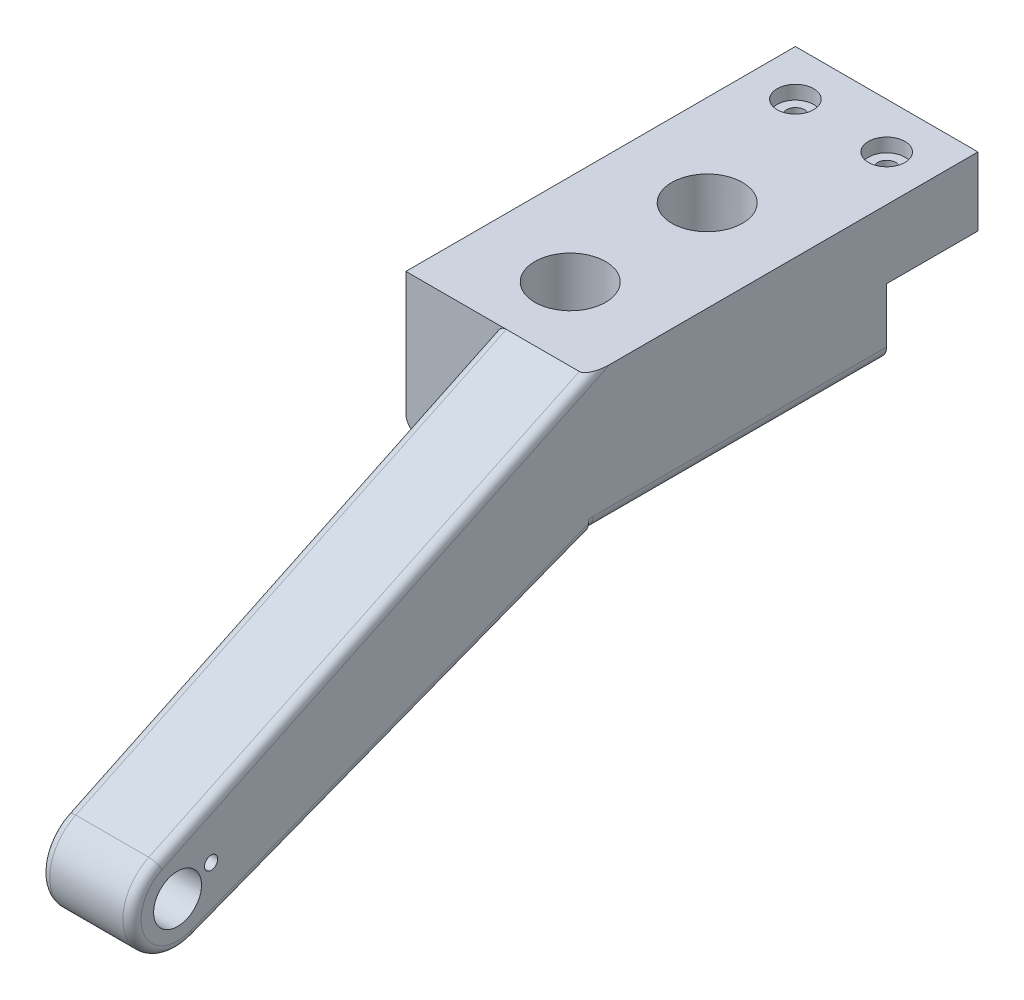
ISO-10303-21;
HEADER;
FILE_DESCRIPTION(('STEP AP214'),'2;1');
FILE_NAME('part.step','',(''),(''),'','','');
FILE_SCHEMA(('AUTOMOTIVE_DESIGN { 1 0 10303 214 1 1 1 1 }'));
ENDSEC;
DATA;
#1=APPLICATION_CONTEXT('core data for automotive mechanical design processes');
#2=APPLICATION_PROTOCOL_DEFINITION('international standard','automotive_design',2000,#1);
#3=PRODUCT_CONTEXT('',#1,'mechanical');
#4=PRODUCT('Part','Part','',(#3));
#5=PRODUCT_RELATED_PRODUCT_CATEGORY('part','',(#4));
#6=PRODUCT_DEFINITION_FORMATION('','',#4);
#7=PRODUCT_DEFINITION_CONTEXT('part definition',#1,'design');
#8=PRODUCT_DEFINITION('design','',#6,#7);
#9=PRODUCT_DEFINITION_SHAPE('','',#8);
#10=(LENGTH_UNIT() NAMED_UNIT(*) SI_UNIT(.MILLI.,.METRE.));
#11=(NAMED_UNIT(*) PLANE_ANGLE_UNIT() SI_UNIT($,.RADIAN.));
#12=(NAMED_UNIT(*) SI_UNIT($,.STERADIAN.) SOLID_ANGLE_UNIT());
#13=UNCERTAINTY_MEASURE_WITH_UNIT(LENGTH_MEASURE(1.E-05),#10,'distance_accuracy_value','');
#14=(GEOMETRIC_REPRESENTATION_CONTEXT(3) GLOBAL_UNCERTAINTY_ASSIGNED_CONTEXT((#13)) GLOBAL_UNIT_ASSIGNED_CONTEXT((#10,
#11,#12)) REPRESENTATION_CONTEXT('',''));
#15=CARTESIAN_POINT('',(0.,0.,0.));
#16=DIRECTION('',(0.,0.,1.));
#17=DIRECTION('',(1.,0.,0.));
#18=AXIS2_PLACEMENT_3D('',#15,#16,#17);
#19=CARTESIAN_POINT('',(-10.,-136.,0.677149560026454));
#20=DIRECTION('',(0.,1.,0.));
#21=DIRECTION('',(0.,0.,1.));
#22=AXIS2_PLACEMENT_3D('',#19,#20,#21);
#23=CYLINDRICAL_SURFACE('',#22,2.);
#24=CARTESIAN_POINT('',(-10.,-15.,0.677149560026454));
#25=DIRECTION('',(0.,-1.,0.));
#26=DIRECTION('',(0.,0.,-1.));
#27=AXIS2_PLACEMENT_3D('',#24,#25,#26);
#28=CIRCLE('',#27,2.);
#29=CARTESIAN_POINT('',(-10.,-15.,-1.32285043997355));
#30=VERTEX_POINT('',#29);
#31=EDGE_CURVE('E171',#30,#30,#28,.T.);
#32=ORIENTED_EDGE('',*,*,#31,.T.);
#33=EDGE_LOOP('',(#32));
#34=FACE_BOUND('',#33,.T.);
#35=CARTESIAN_POINT('',(-10.,-3.,0.677149560026454));
#36=DIRECTION('',(0.,1.,0.));
#37=DIRECTION('',(0.,0.,1.));
#38=AXIS2_PLACEMENT_3D('',#35,#36,#37);
#39=CIRCLE('',#38,2.);
#40=CARTESIAN_POINT('',(-10.,-3.,2.67714956002645));
#41=VERTEX_POINT('',#40);
#42=EDGE_CURVE('E174',#41,#41,#39,.F.);
#43=ORIENTED_EDGE('',*,*,#42,.F.);
#44=EDGE_LOOP('',(#43));
#45=FACE_BOUND('',#44,.T.);
#46=ADVANCED_FACE('F76',(#34,#45),#23,.F.);
#47=CARTESIAN_POINT('',(10.,-136.,0.677149560026454));
#48=DIRECTION('',(0.,1.,0.));
#49=DIRECTION('',(0.,0.,1.));
#50=AXIS2_PLACEMENT_3D('',#47,#48,#49);
#51=CYLINDRICAL_SURFACE('',#50,2.);
#52=CARTESIAN_POINT('',(10.,-15.,0.677149560026454));
#53=DIRECTION('',(0.,-1.,0.));
#54=DIRECTION('',(0.,0.,-1.));
#55=AXIS2_PLACEMENT_3D('',#52,#53,#54);
#56=CIRCLE('',#55,2.);
#57=CARTESIAN_POINT('',(10.,-15.,-1.32285043997355));
#58=VERTEX_POINT('',#57);
#59=EDGE_CURVE('E137',#58,#58,#56,.T.);
#60=ORIENTED_EDGE('',*,*,#59,.T.);
#61=EDGE_LOOP('',(#60));
#62=FACE_BOUND('',#61,.T.);
#63=CARTESIAN_POINT('',(10.,-3.,0.677149560026454));
#64=DIRECTION('',(0.,1.,0.));
#65=DIRECTION('',(0.,0.,1.));
#66=AXIS2_PLACEMENT_3D('',#63,#64,#65);
#67=CIRCLE('',#66,2.);
#68=CARTESIAN_POINT('',(10.,-3.,2.67714956002645));
#69=VERTEX_POINT('',#68);
#70=EDGE_CURVE('E177',#69,#69,#67,.F.);
#71=ORIENTED_EDGE('',*,*,#70,.F.);
#72=EDGE_LOOP('',(#71));
#73=FACE_BOUND('',#72,.T.);
#74=ADVANCED_FACE('F440',(#62,#73),#51,.F.);
#75=CARTESIAN_POINT('',(20.,-30.,75.));
#76=DIRECTION('',(1.,0.,0.));
#77=DIRECTION('',(0.,0.,-1.));
#78=AXIS2_PLACEMENT_3D('',#75,#76,#77);
#79=PLANE('',#78);
#80=CARTESIAN_POINT('',(20.,-50.8479139991392,158.66456978192));
#81=DIRECTION('',(1.,0.,0.));
#82=DIRECTION('',(0.,0.,-1.));
#83=AXIS2_PLACEMENT_3D('',#80,#81,#82);
#84=CIRCLE('',#83,1.45);
#85=CARTESIAN_POINT('',(20.,-50.8479139991392,157.21456978192));
#86=VERTEX_POINT('',#85);
#87=EDGE_CURVE('E196',#86,#86,#84,.T.);
#88=ORIENTED_EDGE('',*,*,#87,.F.);
#89=EDGE_LOOP('',(#88));
#90=FACE_BOUND('',#89,.T.);
#91=CARTESIAN_POINT('',(20.,-54.0121821289708,166.012182128971));
#92=DIRECTION('',(1.,0.,0.));
#93=DIRECTION('',(0.,0.,-1.));
#94=AXIS2_PLACEMENT_3D('',#91,#92,#93);
#95=CIRCLE('',#94,5.25);
#96=CARTESIAN_POINT('',(20.,-54.0121821289708,160.762182128971));
#97=VERTEX_POINT('',#96);
#98=EDGE_CURVE('E185',#97,#97,#95,.T.);
#99=ORIENTED_EDGE('',*,*,#98,.F.);
#100=EDGE_LOOP('',(#99));
#101=FACE_BOUND('',#100,.T.);
#102=DIRECTION('',(0.,0.,-1.));
#103=VECTOR('',#102,1.);
#104=CARTESIAN_POINT('',(20.,-15.,0.));
#105=LINE('',#104,#103);
#106=CARTESIAN_POINT('',(20.,-15.,10.6771495600264));
#107=VERTEX_POINT('',#106);
#108=CARTESIAN_POINT('',(20.,-15.,-9.32285043997355));
#109=VERTEX_POINT('',#108);
#110=EDGE_CURVE('E132',#107,#109,#105,.T.);
#111=ORIENTED_EDGE('',*,*,#110,.T.);
#112=DIRECTION('',(0.,1.,0.));
#113=VECTOR('',#112,1.);
#114=CARTESIAN_POINT('',(20.,0.,-9.32285043997355));
#115=LINE('',#114,#113);
#116=CARTESIAN_POINT('',(20.,0.,-9.32285043997355));
#117=VERTEX_POINT('',#116);
#118=EDGE_CURVE('E136',#109,#117,#115,.T.);
#119=ORIENTED_EDGE('',*,*,#118,.T.);
#120=DIRECTION('',(0.,0.,-1.));
#121=VECTOR('',#120,1.);
#122=CARTESIAN_POINT('',(20.,0.,75.));
#123=LINE('',#122,#121);
#124=CARTESIAN_POINT('',(20.,0.,71.3542991200529));
#125=VERTEX_POINT('',#124);
#126=EDGE_CURVE('E155',#125,#117,#123,.T.);
#127=ORIENTED_EDGE('',*,*,#126,.F.);
#128=DIRECTION('',(0.,0.430505547318578,-0.902587931299733));
#129=VECTOR('',#128,1.);
#130=CARTESIAN_POINT('',(20.,-6.9766575393942,85.9813972726549));
#131=LINE('',#130,#129);
#132=CARTESIAN_POINT('',(20.,-46.7914786785729,169.456226507519));
#133=VERTEX_POINT('',#132);
#134=EDGE_CURVE('E154',#125,#133,#131,.F.);
#135=ORIENTED_EDGE('',*,*,#134,.T.);
#136=CARTESIAN_POINT('',(20.,-54.0121821289708,166.012182128971));
#137=DIRECTION('',(1.,0.,0.));
#138=DIRECTION('',(0.,0.,-1.));
#139=AXIS2_PLACEMENT_3D('',#136,#137,#138);
#140=CIRCLE('',#139,8.00000000000001);
#141=CARTESIAN_POINT('',(20.,-61.4758678697103,163.132356585039));
#142=VERTEX_POINT('',#141);
#143=EDGE_CURVE('E293',#133,#142,#140,.T.);
#144=ORIENTED_EDGE('',*,*,#143,.T.);
#145=DIRECTION('',(0.,0.359978192991459,-0.932960717592442));
#146=VECTOR('',#145,1.);
#147=CARTESIAN_POINT('',(20.,-28.1340785648151,76.7199563859829));
#148=LINE('',#147,#146);
#149=CARTESIAN_POINT('',(20.,-27.8562870201426,76.));
#150=VERTEX_POINT('',#149);
#151=EDGE_CURVE('E289',#142,#150,#148,.T.);
#152=ORIENTED_EDGE('',*,*,#151,.T.);
#153=DIRECTION('',(0.,1.,0.));
#154=VECTOR('',#153,1.);
#155=CARTESIAN_POINT('',(20.,0.,76.));
#156=LINE('',#155,#154);
#157=CARTESIAN_POINT('',(20.,-27.,76.));
#158=VERTEX_POINT('',#157);
#159=EDGE_CURVE('E292',#150,#158,#156,.T.);
#160=ORIENTED_EDGE('',*,*,#159,.T.);
#161=DIRECTION('',(0.,0.,-1.));
#162=VECTOR('',#161,1.);
#163=CARTESIAN_POINT('',(20.,-27.,75.));
#164=LINE('',#163,#162);
#165=CARTESIAN_POINT('',(20.,-27.,75.));
#166=VERTEX_POINT('',#165);
#167=EDGE_CURVE('E148',#158,#166,#164,.T.);
#168=ORIENTED_EDGE('',*,*,#167,.T.);
#169=DIRECTION('',(0.,0.,-1.));
#170=VECTOR('',#169,1.);
#171=CARTESIAN_POINT('',(20.,-27.,-25.));
#172=LINE('',#171,#170);
#173=CARTESIAN_POINT('',(20.,-27.,10.6771495600264));
#174=VERTEX_POINT('',#173);
#175=EDGE_CURVE('E142',#166,#174,#172,.T.);
#176=ORIENTED_EDGE('',*,*,#175,.T.);
#177=DIRECTION('',(0.,1.,0.));
#178=VECTOR('',#177,1.);
#179=CARTESIAN_POINT('',(20.,0.,10.6771495600264));
#180=LINE('',#179,#178);
#181=EDGE_CURVE('E126',#174,#107,#180,.T.);
#182=ORIENTED_EDGE('',*,*,#181,.T.);
#183=EDGE_LOOP('',(#111,#119,#127,#135,#144,#152,#160,#168,#176,#182));
#184=FACE_BOUND('',#183,.T.);
#185=ADVANCED_FACE('F78',(#90,#101,#184),#79,.T.);
#186=CARTESIAN_POINT('',(-20.,-30.,75.));
#187=DIRECTION('',(1.,0.,0.));
#188=DIRECTION('',(0.,0.,-1.));
#189=AXIS2_PLACEMENT_3D('',#186,#187,#188);
#190=PLANE('',#189);
#191=DIRECTION('',(0.,1.,0.));
#192=VECTOR('',#191,1.);
#193=CARTESIAN_POINT('',(-20.,-30.,-9.32285043997355));
#194=LINE('',#193,#192);
#195=CARTESIAN_POINT('',(-20.,-15.,-9.32285043997355));
#196=VERTEX_POINT('',#195);
#197=CARTESIAN_POINT('',(-20.,0.,-9.32285043997355));
#198=VERTEX_POINT('',#197);
#199=EDGE_CURVE('E234',#196,#198,#194,.T.);
#200=ORIENTED_EDGE('',*,*,#199,.F.);
#201=DIRECTION('',(0.,0.,-1.));
#202=VECTOR('',#201,1.);
#203=CARTESIAN_POINT('',(-20.,-15.,75.));
#204=LINE('',#203,#202);
#205=CARTESIAN_POINT('',(-20.,-15.,10.6771495600264));
#206=VERTEX_POINT('',#205);
#207=EDGE_CURVE('E85',#206,#196,#204,.T.);
#208=ORIENTED_EDGE('',*,*,#207,.F.);
#209=DIRECTION('',(0.,1.,0.));
#210=VECTOR('',#209,1.);
#211=CARTESIAN_POINT('',(-20.,-30.,10.6771495600265));
#212=LINE('',#211,#210);
#213=CARTESIAN_POINT('',(-20.,-27.,10.6771495600264));
#214=VERTEX_POINT('',#213);
#215=EDGE_CURVE('E129',#214,#206,#212,.T.);
#216=ORIENTED_EDGE('',*,*,#215,.F.);
#217=DIRECTION('',(0.,0.,-1.));
#218=VECTOR('',#217,1.);
#219=CARTESIAN_POINT('',(-20.,-27.,75.));
#220=LINE('',#219,#218);
#221=CARTESIAN_POINT('',(-20.,-27.,75.));
#222=VERTEX_POINT('',#221);
#223=EDGE_CURVE('E143',#214,#222,#220,.F.);
#224=ORIENTED_EDGE('',*,*,#223,.T.);
#225=DIRECTION('',(0.,0.,-1.));
#226=VECTOR('',#225,1.);
#227=CARTESIAN_POINT('',(-20.,-27.,75.));
#228=LINE('',#227,#226);
#229=CARTESIAN_POINT('',(-20.,-27.,76.));
#230=VERTEX_POINT('',#229);
#231=EDGE_CURVE('E146',#222,#230,#228,.F.);
#232=ORIENTED_EDGE('',*,*,#231,.T.);
#233=DIRECTION('',(0.,-1.,0.));
#234=VECTOR('',#233,1.);
#235=CARTESIAN_POINT('',(-20.,0.,76.));
#236=LINE('',#235,#234);
#237=CARTESIAN_POINT('',(-20.,0.,76.));
#238=VERTEX_POINT('',#237);
#239=EDGE_CURVE('E244',#238,#230,#236,.T.);
#240=ORIENTED_EDGE('',*,*,#239,.F.);
#241=DIRECTION('',(0.,0.,-1.));
#242=VECTOR('',#241,1.);
#243=CARTESIAN_POINT('',(-20.,0.,75.));
#244=LINE('',#243,#242);
#245=EDGE_CURVE('E159',#238,#198,#244,.T.);
#246=ORIENTED_EDGE('',*,*,#245,.T.);
#247=EDGE_LOOP('',(#200,#208,#216,#224,#232,#240,#246));
#248=FACE_BOUND('',#247,.T.);
#249=ADVANCED_FACE('F539',(#248),#190,.F.);
#250=CARTESIAN_POINT('',(0.,0.,0.));
#251=DIRECTION('',(0.,1.,0.));
#252=DIRECTION('',(0.,0.,1.));
#253=AXIS2_PLACEMENT_3D('',#250,#251,#252);
#254=PLANE('',#253);
#255=CARTESIAN_POINT('',(0.,0.,60.));
#256=DIRECTION('',(0.,1.,0.));
#257=DIRECTION('',(0.,0.,1.));
#258=AXIS2_PLACEMENT_3D('',#255,#256,#257);
#259=CIRCLE('',#258,7.75);
#260=CARTESIAN_POINT('',(0.,0.,67.75));
#261=VERTEX_POINT('',#260);
#262=EDGE_CURVE('E199',#261,#261,#259,.T.);
#263=ORIENTED_EDGE('',*,*,#262,.F.);
#264=EDGE_LOOP('',(#263));
#265=FACE_BOUND('',#264,.T.);
#266=CARTESIAN_POINT('',(0.,0.,30.));
#267=DIRECTION('',(0.,1.,0.));
#268=DIRECTION('',(0.,0.,1.));
#269=AXIS2_PLACEMENT_3D('',#266,#267,#268);
#270=CIRCLE('',#269,7.75);
#271=CARTESIAN_POINT('',(0.,0.,37.75));
#272=VERTEX_POINT('',#271);
#273=EDGE_CURVE('E184',#272,#272,#270,.T.);
#274=ORIENTED_EDGE('',*,*,#273,.F.);
#275=EDGE_LOOP('',(#274));
#276=FACE_BOUND('',#275,.T.);
#277=CARTESIAN_POINT('',(10.,0.,0.677149560026454));
#278=DIRECTION('',(0.,1.,0.));
#279=DIRECTION('',(0.,0.,1.));
#280=AXIS2_PLACEMENT_3D('',#277,#278,#279);
#281=CIRCLE('',#280,4.);
#282=CARTESIAN_POINT('',(10.,0.,4.67714956002646));
#283=VERTEX_POINT('',#282);
#284=EDGE_CURVE('E210',#283,#283,#281,.T.);
#285=ORIENTED_EDGE('',*,*,#284,.F.);
#286=EDGE_LOOP('',(#285));
#287=FACE_BOUND('',#286,.T.);
#288=CARTESIAN_POINT('',(-10.,0.,0.677149560026454));
#289=DIRECTION('',(0.,1.,0.));
#290=DIRECTION('',(0.,0.,1.));
#291=AXIS2_PLACEMENT_3D('',#288,#289,#290);
#292=CIRCLE('',#291,4.);
#293=CARTESIAN_POINT('',(-10.,0.,4.67714956002646));
#294=VERTEX_POINT('',#293);
#295=EDGE_CURVE('E204',#294,#294,#292,.T.);
#296=ORIENTED_EDGE('',*,*,#295,.F.);
#297=EDGE_LOOP('',(#296));
#298=FACE_BOUND('',#297,.T.);
#299=ORIENTED_EDGE('',*,*,#126,.T.);
#300=DIRECTION('',(-1.,0.,0.));
#301=VECTOR('',#300,1.);
#302=CARTESIAN_POINT('',(0.,0.,-9.32285043997355));
#303=LINE('',#302,#301);
#304=EDGE_CURVE('E158',#117,#198,#303,.T.);
#305=ORIENTED_EDGE('',*,*,#304,.T.);
#306=ORIENTED_EDGE('',*,*,#245,.F.);
#307=DIRECTION('',(1.,0.,0.));
#308=VECTOR('',#307,1.);
#309=CARTESIAN_POINT('',(20.,0.,76.));
#310=LINE('',#309,#308);
#311=CARTESIAN_POINT('',(2.00000000000003,0.,76.));
#312=VERTEX_POINT('',#311);
#313=EDGE_CURVE('E221',#238,#312,#310,.T.);
#314=ORIENTED_EDGE('',*,*,#313,.T.);
#315=DIRECTION('',(-1.,0.,0.));
#316=VECTOR('',#315,1.);
#317=CARTESIAN_POINT('',(104.165905469516,0.,76.));
#318=LINE('',#317,#316);
#319=CARTESIAN_POINT('',(18.,0.,76.));
#320=VERTEX_POINT('',#319);
#321=EDGE_CURVE('E256',#320,#312,#318,.T.);
#322=ORIENTED_EDGE('',*,*,#321,.F.);
#323=CARTESIAN_POINT('',(18.,0.,71.3542991200529));
#324=DIRECTION('',(0.,1.,0.));
#325=DIRECTION('',(0.,0.,-1.));
#326=AXIS2_PLACEMENT_3D('',#323,#324,#325);
#327=ELLIPSE('',#326,4.64570087994704,2.);
#328=EDGE_CURVE('E250',#320,#125,#327,.T.);
#329=ORIENTED_EDGE('',*,*,#328,.T.);
#330=EDGE_LOOP('',(#299,#305,#306,#314,#322,#329));
#331=FACE_BOUND('',#330,.T.);
#332=ADVANCED_FACE('F536',(#265,#276,#287,#298,#331),#254,.T.);
#333=CARTESIAN_POINT('',(0.,-30.,0.));
#334=DIRECTION('',(0.,1.,0.));
#335=DIRECTION('',(0.,0.,1.));
#336=AXIS2_PLACEMENT_3D('',#333,#334,#335);
#337=PLANE('',#336);
#338=CARTESIAN_POINT('',(0.,-30.,60.));
#339=DIRECTION('',(0.,-1.,0.));
#340=DIRECTION('',(0.,0.,-1.));
#341=AXIS2_PLACEMENT_3D('',#338,#339,#340);
#342=CIRCLE('',#341,6.);
#343=CARTESIAN_POINT('',(0.,-30.,54.));
#344=VERTEX_POINT('',#343);
#345=EDGE_CURVE('E310',#344,#344,#342,.T.);
#346=ORIENTED_EDGE('',*,*,#345,.F.);
#347=EDGE_LOOP('',(#346));
#348=FACE_BOUND('',#347,.T.);
#349=CARTESIAN_POINT('',(0.,-30.,30.));
#350=DIRECTION('',(0.,-1.,0.));
#351=DIRECTION('',(0.,0.,-1.));
#352=AXIS2_PLACEMENT_3D('',#349,#350,#351);
#353=CIRCLE('',#352,6.);
#354=CARTESIAN_POINT('',(0.,-30.,24.));
#355=VERTEX_POINT('',#354);
#356=EDGE_CURVE('E288',#355,#355,#353,.T.);
#357=ORIENTED_EDGE('',*,*,#356,.F.);
#358=EDGE_LOOP('',(#357));
#359=FACE_BOUND('',#358,.T.);
#360=DIRECTION('',(1.,0.,0.));
#361=VECTOR('',#360,1.);
#362=CARTESIAN_POINT('',(-29.,-30.,10.6771495600264));
#363=LINE('',#362,#361);
#364=CARTESIAN_POINT('',(-17.,-30.,10.6771495600264));
#365=VERTEX_POINT('',#364);
#366=CARTESIAN_POINT('',(17.,-30.,10.6771495600265));
#367=VERTEX_POINT('',#366);
#368=EDGE_CURVE('E151',#365,#367,#363,.T.);
#369=ORIENTED_EDGE('',*,*,#368,.T.);
#370=DIRECTION('',(0.,0.,-1.));
#371=VECTOR('',#370,1.);
#372=CARTESIAN_POINT('',(17.,-30.,135.));
#373=LINE('',#372,#371);
#374=CARTESIAN_POINT('',(17.,-30.,75.));
#375=VERTEX_POINT('',#374);
#376=EDGE_CURVE('E165',#367,#375,#373,.F.);
#377=ORIENTED_EDGE('',*,*,#376,.T.);
#378=DIRECTION('',(0.,0.,-1.));
#379=VECTOR('',#378,1.);
#380=CARTESIAN_POINT('',(17.,-30.,76.));
#381=LINE('',#380,#379);
#382=CARTESIAN_POINT('',(17.,-30.,76.));
#383=VERTEX_POINT('',#382);
#384=EDGE_CURVE('E167',#375,#383,#381,.F.);
#385=ORIENTED_EDGE('',*,*,#384,.T.);
#386=DIRECTION('',(1.,0.,0.));
#387=VECTOR('',#386,1.);
#388=CARTESIAN_POINT('',(20.,-30.,76.));
#389=LINE('',#388,#387);
#390=CARTESIAN_POINT('',(2.,-30.,76.));
#391=VERTEX_POINT('',#390);
#392=EDGE_CURVE('E238',#391,#383,#389,.T.);
#393=ORIENTED_EDGE('',*,*,#392,.F.);
#394=CARTESIAN_POINT('',(-17.,-30.,76.));
#395=VERTEX_POINT('',#394);
#396=EDGE_CURVE('E249',#395,#391,#389,.T.);
#397=ORIENTED_EDGE('',*,*,#396,.F.);
#398=DIRECTION('',(0.,0.,-1.));
#399=VECTOR('',#398,1.);
#400=CARTESIAN_POINT('',(-17.,-30.,0.));
#401=LINE('',#400,#399);
#402=CARTESIAN_POINT('',(-17.,-30.,75.));
#403=VERTEX_POINT('',#402);
#404=EDGE_CURVE('E164',#395,#403,#401,.T.);
#405=ORIENTED_EDGE('',*,*,#404,.T.);
#406=DIRECTION('',(0.,0.,-1.));
#407=VECTOR('',#406,1.);
#408=CARTESIAN_POINT('',(-17.,-30.,0.));
#409=LINE('',#408,#407);
#410=EDGE_CURVE('E160',#403,#365,#409,.T.);
#411=ORIENTED_EDGE('',*,*,#410,.T.);
#412=EDGE_LOOP('',(#369,#377,#385,#393,#397,#405,#411));
#413=FACE_BOUND('',#412,.T.);
#414=ADVANCED_FACE('F351',(#348,#359,#413),#337,.F.);
#415=CARTESIAN_POINT('',(17.,-27.,75.));
#416=DIRECTION('',(0.,0.,1.));
#417=DIRECTION('',(1.,0.,0.));
#418=AXIS2_PLACEMENT_3D('',#415,#416,#417);
#419=CYLINDRICAL_SURFACE('',#418,3.);
#420=ORIENTED_EDGE('',*,*,#376,.F.);
#421=CARTESIAN_POINT('',(17.,-27.,10.6771495600265));
#422=DIRECTION('',(0.,0.,-1.));
#423=DIRECTION('',(-1.,0.,0.));
#424=AXIS2_PLACEMENT_3D('',#421,#422,#423);
#425=CIRCLE('',#424,3.);
#426=EDGE_CURVE('E163',#367,#174,#425,.F.);
#427=ORIENTED_EDGE('',*,*,#426,.T.);
#428=ORIENTED_EDGE('',*,*,#175,.F.);
#429=CARTESIAN_POINT('',(17.,-27.,75.));
#430=DIRECTION('',(0.,0.,1.));
#431=DIRECTION('',(1.,0.,0.));
#432=AXIS2_PLACEMENT_3D('',#429,#430,#431);
#433=CIRCLE('',#432,3.);
#434=EDGE_CURVE('E226',#166,#375,#433,.F.);
#435=ORIENTED_EDGE('',*,*,#434,.T.);
#436=EDGE_LOOP('',(#420,#427,#428,#435));
#437=FACE_BOUND('',#436,.T.);
#438=ADVANCED_FACE('F347',(#437),#419,.T.);
#439=CARTESIAN_POINT('',(-17.,-27.,0.));
#440=DIRECTION('',(0.,0.,-1.));
#441=DIRECTION('',(-1.,0.,0.));
#442=AXIS2_PLACEMENT_3D('',#439,#440,#441);
#443=CYLINDRICAL_SURFACE('',#442,3.);
#444=ORIENTED_EDGE('',*,*,#223,.F.);
#445=CARTESIAN_POINT('',(-17.,-27.,10.6771495600264));
#446=DIRECTION('',(0.,0.,-1.));
#447=DIRECTION('',(-1.,0.,0.));
#448=AXIS2_PLACEMENT_3D('',#445,#446,#447);
#449=CIRCLE('',#448,3.);
#450=EDGE_CURVE('E222',#214,#365,#449,.F.);
#451=ORIENTED_EDGE('',*,*,#450,.T.);
#452=ORIENTED_EDGE('',*,*,#410,.F.);
#453=CARTESIAN_POINT('',(-17.,-27.,75.));
#454=DIRECTION('',(0.,0.,1.));
#455=DIRECTION('',(1.,0.,0.));
#456=AXIS2_PLACEMENT_3D('',#453,#454,#455);
#457=CIRCLE('',#456,3.);
#458=EDGE_CURVE('E225',#403,#222,#457,.F.);
#459=ORIENTED_EDGE('',*,*,#458,.T.);
#460=EDGE_LOOP('',(#444,#451,#452,#459));
#461=FACE_BOUND('',#460,.T.);
#462=ADVANCED_FACE('F360',(#461),#443,.T.);
#463=CARTESIAN_POINT('',(0.,-50.0121821289708,125.012182128971));
#464=DIRECTION('',(1.,0.,0.));
#465=DIRECTION('',(0.,0.,-1.));
#466=AXIS2_PLACEMENT_3D('',#463,#464,#465);
#467=PLANE('',#466);
#468=CARTESIAN_POINT('',(0.,-50.8479139991392,158.66456978192));
#469=DIRECTION('',(1.,0.,0.));
#470=DIRECTION('',(0.,0.,-1.));
#471=AXIS2_PLACEMENT_3D('',#468,#469,#470);
#472=CIRCLE('',#471,1.45);
#473=CARTESIAN_POINT('',(0.,-50.8479139991392,157.21456978192));
#474=VERTEX_POINT('',#473);
#475=EDGE_CURVE('E80',#474,#474,#472,.T.);
#476=ORIENTED_EDGE('',*,*,#475,.T.);
#477=EDGE_LOOP('',(#476));
#478=FACE_BOUND('',#477,.T.);
#479=CARTESIAN_POINT('',(0.,-54.0121821289708,166.012182128971));
#480=DIRECTION('',(1.,0.,0.));
#481=DIRECTION('',(0.,0.,-1.));
#482=AXIS2_PLACEMENT_3D('',#479,#480,#481);
#483=CIRCLE('',#482,5.25);
#484=CARTESIAN_POINT('',(0.,-54.0121821289708,160.762182128971));
#485=VERTEX_POINT('',#484);
#486=EDGE_CURVE('E182',#485,#485,#483,.T.);
#487=ORIENTED_EDGE('',*,*,#486,.T.);
#488=EDGE_LOOP('',(#487));
#489=FACE_BOUND('',#488,.T.);
#490=DIRECTION('',(0.,1.,0.));
#491=VECTOR('',#490,1.);
#492=CARTESIAN_POINT('',(0.,0.,76.));
#493=LINE('',#492,#491);
#494=CARTESIAN_POINT('',(0.,-27.8562870201426,76.));
#495=VERTEX_POINT('',#494);
#496=CARTESIAN_POINT('',(0.,-2.21585058989212,76.));
#497=VERTEX_POINT('',#496);
#498=EDGE_CURVE('E245',#495,#497,#493,.T.);
#499=ORIENTED_EDGE('',*,*,#498,.F.);
#500=DIRECTION('',(0.,0.359978192991459,-0.932960717592442));
#501=VECTOR('',#500,1.);
#502=CARTESIAN_POINT('',(0.,-47.1878646287041,126.101930808641));
#503=LINE('',#502,#501);
#504=CARTESIAN_POINT('',(0.,-61.4758678697103,163.132356585039));
#505=VERTEX_POINT('',#504);
#506=EDGE_CURVE('E262',#495,#505,#503,.F.);
#507=ORIENTED_EDGE('',*,*,#506,.T.);
#508=CARTESIAN_POINT('',(0.,-54.0121821289708,166.012182128971));
#509=DIRECTION('',(1.,0.,0.));
#510=DIRECTION('',(0.,0.,-1.));
#511=AXIS2_PLACEMENT_3D('',#508,#509,#510);
#512=CIRCLE('',#511,8.00000000000001);
#513=CARTESIAN_POINT('',(0.,-46.7914786785729,169.456226507519));
#514=VERTEX_POINT('',#513);
#515=EDGE_CURVE('E265',#505,#514,#512,.F.);
#516=ORIENTED_EDGE('',*,*,#515,.T.);
#517=DIRECTION('',(0.,0.430505547318578,-0.902587931299733));
#518=VECTOR('',#517,1.);
#519=CARTESIAN_POINT('',(0.,-1.80517586259947,75.1389889053628));
#520=LINE('',#519,#518);
#521=EDGE_CURVE('E268',#514,#497,#520,.T.);
#522=ORIENTED_EDGE('',*,*,#521,.T.);
#523=EDGE_LOOP('',(#499,#507,#516,#522));
#524=FACE_BOUND('',#523,.T.);
#525=ADVANCED_FACE('F480',(#478,#489,#524),#467,.F.);
#526=CARTESIAN_POINT('',(0.,0.,76.));
#527=DIRECTION('',(0.,0.,1.));
#528=DIRECTION('',(1.,0.,0.));
#529=AXIS2_PLACEMENT_3D('',#526,#527,#528);
#530=PLANE('',#529);
#531=ORIENTED_EDGE('',*,*,#396,.T.);
#532=CARTESIAN_POINT('',(2.,-27.8562870201426,76.));
#533=DIRECTION('',(0.,0.,1.));
#534=DIRECTION('',(0.,1.,0.));
#535=AXIS2_PLACEMENT_3D('',#532,#533,#534);
#536=ELLIPSE('',#535,2.14371297985741,2.);
#537=EDGE_CURVE('E246',#391,#495,#536,.F.);
#538=ORIENTED_EDGE('',*,*,#537,.T.);
#539=ORIENTED_EDGE('',*,*,#498,.T.);
#540=CARTESIAN_POINT('',(2.,-2.21585058989211,76.));
#541=DIRECTION('',(0.,0.,1.));
#542=DIRECTION('',(0.,-1.,0.));
#543=AXIS2_PLACEMENT_3D('',#540,#541,#542);
#544=ELLIPSE('',#543,2.2158505898921,2.);
#545=EDGE_CURVE('E241',#497,#312,#544,.F.);
#546=ORIENTED_EDGE('',*,*,#545,.T.);
#547=ORIENTED_EDGE('',*,*,#313,.F.);
#548=ORIENTED_EDGE('',*,*,#239,.T.);
#549=CARTESIAN_POINT('',(-17.,-27.,76.));
#550=DIRECTION('',(0.,0.,1.));
#551=DIRECTION('',(1.,0.,0.));
#552=AXIS2_PLACEMENT_3D('',#549,#550,#551);
#553=CIRCLE('',#552,3.);
#554=EDGE_CURVE('E300',#230,#395,#553,.T.);
#555=ORIENTED_EDGE('',*,*,#554,.T.);
#556=EDGE_LOOP('',(#531,#538,#539,#546,#547,#548,#555));
#557=FACE_BOUND('',#556,.T.);
#558=ADVANCED_FACE('F476',(#557),#530,.T.);
#559=CARTESIAN_POINT('',(0.,-25.,60.));
#560=DIRECTION('',(0.,-1.,0.));
#561=DIRECTION('',(0.,0.,-1.));
#562=AXIS2_PLACEMENT_3D('',#559,#560,#561);
#563=PLANE('',#562);
#564=CARTESIAN_POINT('',(0.,-25.,60.));
#565=DIRECTION('',(0.,-1.,0.));
#566=DIRECTION('',(0.,0.,-1.));
#567=AXIS2_PLACEMENT_3D('',#564,#565,#566);
#568=CIRCLE('',#567,6.);
#569=CARTESIAN_POINT('',(0.,-25.,54.));
#570=VERTEX_POINT('',#569);
#571=EDGE_CURVE('E313',#570,#570,#568,.T.);
#572=ORIENTED_EDGE('',*,*,#571,.T.);
#573=EDGE_LOOP('',(#572));
#574=FACE_BOUND('',#573,.T.);
#575=CARTESIAN_POINT('',(0.,-25.,60.));
#576=DIRECTION('',(0.,-1.,0.));
#577=DIRECTION('',(0.,0.,-1.));
#578=AXIS2_PLACEMENT_3D('',#575,#576,#577);
#579=CIRCLE('',#578,7.75);
#580=CARTESIAN_POINT('',(0.,-25.,52.25));
#581=VERTEX_POINT('',#580);
#582=EDGE_CURVE('E202',#581,#581,#579,.F.);
#583=ORIENTED_EDGE('',*,*,#582,.T.);
#584=EDGE_LOOP('',(#583));
#585=FACE_BOUND('',#584,.T.);
#586=ADVANCED_FACE('F479',(#574,#585),#563,.F.);
#587=CARTESIAN_POINT('',(0.,-25.,60.));
#588=DIRECTION('',(0.,-1.,0.));
#589=DIRECTION('',(0.,0.,-1.));
#590=AXIS2_PLACEMENT_3D('',#587,#588,#589);
#591=CYLINDRICAL_SURFACE('',#590,6.);
#592=ORIENTED_EDGE('',*,*,#571,.F.);
#593=EDGE_LOOP('',(#592));
#594=FACE_BOUND('',#593,.T.);
#595=ORIENTED_EDGE('',*,*,#345,.T.);
#596=EDGE_LOOP('',(#595));
#597=FACE_BOUND('',#596,.T.);
#598=ADVANCED_FACE('F487',(#594,#597),#591,.F.);
#599=CARTESIAN_POINT('',(0.,-25.,30.));
#600=DIRECTION('',(0.,-1.,0.));
#601=DIRECTION('',(0.,0.,-1.));
#602=AXIS2_PLACEMENT_3D('',#599,#600,#601);
#603=PLANE('',#602);
#604=CARTESIAN_POINT('',(0.,-25.,30.));
#605=DIRECTION('',(0.,-1.,0.));
#606=DIRECTION('',(0.,0.,-1.));
#607=AXIS2_PLACEMENT_3D('',#604,#605,#606);
#608=CIRCLE('',#607,6.);
#609=CARTESIAN_POINT('',(0.,-25.,24.));
#610=VERTEX_POINT('',#609);
#611=EDGE_CURVE('E307',#610,#610,#608,.T.);
#612=ORIENTED_EDGE('',*,*,#611,.T.);
#613=EDGE_LOOP('',(#612));
#614=FACE_BOUND('',#613,.T.);
#615=CARTESIAN_POINT('',(0.,-25.,30.));
#616=DIRECTION('',(0.,-1.,0.));
#617=DIRECTION('',(0.,0.,-1.));
#618=AXIS2_PLACEMENT_3D('',#615,#616,#617);
#619=CIRCLE('',#618,7.75);
#620=CARTESIAN_POINT('',(0.,-25.,22.25));
#621=VERTEX_POINT('',#620);
#622=EDGE_CURVE('E189',#621,#621,#619,.F.);
#623=ORIENTED_EDGE('',*,*,#622,.T.);
#624=EDGE_LOOP('',(#623));
#625=FACE_BOUND('',#624,.T.);
#626=ADVANCED_FACE('F483',(#614,#625),#603,.F.);
#627=CARTESIAN_POINT('',(0.,-25.,30.));
#628=DIRECTION('',(0.,-1.,0.));
#629=DIRECTION('',(0.,0.,-1.));
#630=AXIS2_PLACEMENT_3D('',#627,#628,#629);
#631=CYLINDRICAL_SURFACE('',#630,6.);
#632=ORIENTED_EDGE('',*,*,#611,.F.);
#633=EDGE_LOOP('',(#632));
#634=FACE_BOUND('',#633,.T.);
#635=ORIENTED_EDGE('',*,*,#356,.T.);
#636=EDGE_LOOP('',(#635));
#637=FACE_BOUND('',#636,.T.);
#638=ADVANCED_FACE('F437',(#634,#637),#631,.F.);
#639=CARTESIAN_POINT('',(-17.,-27.,0.));
#640=DIRECTION('',(0.,0.,-1.));
#641=DIRECTION('',(-1.,0.,0.));
#642=AXIS2_PLACEMENT_3D('',#639,#640,#641);
#643=CYLINDRICAL_SURFACE('',#642,3.);
#644=ORIENTED_EDGE('',*,*,#554,.F.);
#645=ORIENTED_EDGE('',*,*,#231,.F.);
#646=ORIENTED_EDGE('',*,*,#458,.F.);
#647=ORIENTED_EDGE('',*,*,#404,.F.);
#648=EDGE_LOOP('',(#644,#645,#646,#647));
#649=FACE_BOUND('',#648,.T.);
#650=ADVANCED_FACE('F429',(#649),#643,.T.);
#651=CARTESIAN_POINT('',(17.,-27.,75.));
#652=DIRECTION('',(0.,0.,1.));
#653=DIRECTION('',(1.,0.,0.));
#654=AXIS2_PLACEMENT_3D('',#651,#652,#653);
#655=CYLINDRICAL_SURFACE('',#654,3.);
#656=CARTESIAN_POINT('',(17.,-27.,76.));
#657=DIRECTION('',(0.,0.,1.));
#658=DIRECTION('',(1.,0.,0.));
#659=AXIS2_PLACEMENT_3D('',#656,#657,#658);
#660=CIRCLE('',#659,3.);
#661=EDGE_CURVE('E275',#383,#158,#660,.T.);
#662=ORIENTED_EDGE('',*,*,#661,.F.);
#663=ORIENTED_EDGE('',*,*,#384,.F.);
#664=ORIENTED_EDGE('',*,*,#434,.F.);
#665=ORIENTED_EDGE('',*,*,#167,.F.);
#666=EDGE_LOOP('',(#662,#663,#664,#665));
#667=FACE_BOUND('',#666,.T.);
#668=ADVANCED_FACE('F427',(#667),#655,.T.);
#669=CARTESIAN_POINT('',(104.165905469516,0.,76.));
#670=DIRECTION('',(0.,0.,1.));
#671=DIRECTION('',(1.,0.,0.));
#672=AXIS2_PLACEMENT_3D('',#669,#670,#671);
#673=PLANE('',#672);
#674=ORIENTED_EDGE('',*,*,#159,.F.);
#675=CARTESIAN_POINT('',(18.,-27.8562870201426,76.));
#676=DIRECTION('',(0.,0.,1.));
#677=DIRECTION('',(0.,-1.,0.));
#678=AXIS2_PLACEMENT_3D('',#675,#676,#677);
#679=ELLIPSE('',#678,2.14371297985741,2.);
#680=CARTESIAN_POINT('',(18.,-30.,76.));
#681=VERTEX_POINT('',#680);
#682=EDGE_CURVE('E284',#150,#681,#679,.F.);
#683=ORIENTED_EDGE('',*,*,#682,.T.);
#684=DIRECTION('',(-1.,0.,0.));
#685=VECTOR('',#684,1.);
#686=CARTESIAN_POINT('',(104.165905469516,-30.,76.));
#687=LINE('',#686,#685);
#688=EDGE_CURVE('E287',#681,#383,#687,.T.);
#689=ORIENTED_EDGE('',*,*,#688,.T.);
#690=ORIENTED_EDGE('',*,*,#661,.T.);
#691=EDGE_LOOP('',(#674,#683,#689,#690));
#692=FACE_BOUND('',#691,.T.);
#693=ADVANCED_FACE('F422',(#692),#673,.F.);
#694=CARTESIAN_POINT('',(20.,-54.0121821289708,166.012182128971));
#695=DIRECTION('',(-1.,0.,0.));
#696=DIRECTION('',(0.,0.,1.));
#697=AXIS2_PLACEMENT_3D('',#694,#695,#696);
#698=CYLINDRICAL_SURFACE('',#697,10.);
#699=DIRECTION('',(-1.,0.,0.));
#700=VECTOR('',#699,1.);
#701=CARTESIAN_POINT('',(20.,-63.3417893048952,162.412400199056));
#702=LINE('',#701,#700);
#703=CARTESIAN_POINT('',(18.,-63.3417893048952,162.412400199056));
#704=VERTEX_POINT('',#703);
#705=CARTESIAN_POINT('',(2.00000000000001,-63.3417893048952,162.412400199056));
#706=VERTEX_POINT('',#705);
#707=EDGE_CURVE('E280',#704,#706,#702,.T.);
#708=ORIENTED_EDGE('',*,*,#707,.F.);
#709=CARTESIAN_POINT('',(18.,-54.0121821289708,166.012182128971));
#710=DIRECTION('',(1.,0.,0.));
#711=DIRECTION('',(0.,0.,-1.));
#712=AXIS2_PLACEMENT_3D('',#709,#710,#711);
#713=CIRCLE('',#712,10.);
#714=CARTESIAN_POINT('',(18.,-44.9863028159734,170.317237602157));
#715=VERTEX_POINT('',#714);
#716=EDGE_CURVE('E271',#704,#715,#713,.F.);
#717=ORIENTED_EDGE('',*,*,#716,.T.);
#718=DIRECTION('',(-1.,0.,0.));
#719=VECTOR('',#718,1.);
#720=CARTESIAN_POINT('',(20.,-44.9863028159734,170.317237602157));
#721=LINE('',#720,#719);
#722=CARTESIAN_POINT('',(2.00000000000001,-44.9863028159734,170.317237602157));
#723=VERTEX_POINT('',#722);
#724=EDGE_CURVE('E274',#715,#723,#721,.T.);
#725=ORIENTED_EDGE('',*,*,#724,.T.);
#726=CARTESIAN_POINT('',(2.,-54.0121821289708,166.012182128971));
#727=DIRECTION('',(1.,0.,0.));
#728=DIRECTION('',(0.,0.,-1.));
#729=AXIS2_PLACEMENT_3D('',#726,#727,#728);
#730=CIRCLE('',#729,10.);
#731=EDGE_CURVE('E257',#723,#706,#730,.T.);
#732=ORIENTED_EDGE('',*,*,#731,.T.);
#733=EDGE_LOOP('',(#708,#717,#725,#732));
#734=FACE_BOUND('',#733,.T.);
#735=ADVANCED_FACE('F435',(#734),#698,.T.);
#736=CARTESIAN_POINT('',(20.,29.5312524639174,14.0854619966772));
#737=DIRECTION('',(0.,0.902587931299733,0.430505547318578));
#738=DIRECTION('',(0.,-0.430505547318578,0.902587931299733));
#739=AXIS2_PLACEMENT_3D('',#736,#737,#738);
#740=PLANE('',#739);
#741=ORIENTED_EDGE('',*,*,#724,.F.);
#742=DIRECTION('',(0.,0.430505547318578,-0.902587931299733));
#743=VECTOR('',#742,1.);
#744=CARTESIAN_POINT('',(18.,29.5312524639174,14.0854619966772));
#745=LINE('',#744,#743);
#746=EDGE_CURVE('E253',#715,#320,#745,.T.);
#747=ORIENTED_EDGE('',*,*,#746,.T.);
#748=ORIENTED_EDGE('',*,*,#321,.T.);
#749=DIRECTION('',(0.,0.430505547318578,-0.902587931299733));
#750=VECTOR('',#749,1.);
#751=CARTESIAN_POINT('',(2.,-44.9863028159735,170.317237602157));
#752=LINE('',#751,#750);
#753=EDGE_CURVE('E258',#312,#723,#752,.F.);
#754=ORIENTED_EDGE('',*,*,#753,.T.);
#755=EDGE_LOOP('',(#741,#747,#748,#754));
#756=FACE_BOUND('',#755,.T.);
#757=ADVANCED_FACE('F553',(#756),#740,.T.);
#758=CARTESIAN_POINT('',(20.,-0.588212010046512,-0.226958640894156));
#759=DIRECTION('',(0.,0.932960717592442,0.359978192991459));
#760=DIRECTION('',(0.,-0.359978192991459,0.932960717592442));
#761=AXIS2_PLACEMENT_3D('',#758,#759,#760);
#762=PLANE('',#761);
#763=ORIENTED_EDGE('',*,*,#688,.F.);
#764=DIRECTION('',(0.,0.359978192991459,-0.932960717592442));
#765=VECTOR('',#764,1.);
#766=CARTESIAN_POINT('',(18.,-63.3417893048952,162.412400199056));
#767=LINE('',#766,#765);
#768=EDGE_CURVE('E261',#681,#704,#767,.F.);
#769=ORIENTED_EDGE('',*,*,#768,.T.);
#770=ORIENTED_EDGE('',*,*,#707,.T.);
#771=DIRECTION('',(0.,0.359978192991459,-0.932960717592442));
#772=VECTOR('',#771,1.);
#773=CARTESIAN_POINT('',(2.,-0.588212010046512,-0.226958640894156));
#774=LINE('',#773,#772);
#775=EDGE_CURVE('E281',#706,#391,#774,.T.);
#776=ORIENTED_EDGE('',*,*,#775,.T.);
#777=ORIENTED_EDGE('',*,*,#392,.T.);
#778=EDGE_LOOP('',(#763,#769,#770,#776,#777));
#779=FACE_BOUND('',#778,.T.);
#780=ADVANCED_FACE('F419',(#779),#762,.F.);
#781=CARTESIAN_POINT('',(18.,27.726076601318,13.22445090204));
#782=DIRECTION('',(0.,0.430505547318578,-0.902587931299733));
#783=DIRECTION('',(0.,0.902587931299733,0.430505547318578));
#784=AXIS2_PLACEMENT_3D('',#781,#782,#783);
#785=CYLINDRICAL_SURFACE('',#784,2.);
#786=ORIENTED_EDGE('',*,*,#328,.F.);
#787=ORIENTED_EDGE('',*,*,#746,.F.);
#788=CARTESIAN_POINT('',(18.,-46.7914786785729,169.456226507519));
#789=DIRECTION('',(0.,-0.43050554731858,0.902587931299732));
#790=DIRECTION('',(0.,-0.902587931299732,-0.430505547318581));
#791=AXIS2_PLACEMENT_3D('',#788,#789,#790);
#792=CIRCLE('',#791,2.);
#793=EDGE_CURVE('E235',#133,#715,#792,.T.);
#794=ORIENTED_EDGE('',*,*,#793,.F.);
#795=ORIENTED_EDGE('',*,*,#134,.F.);
#796=EDGE_LOOP('',(#786,#787,#794,#795));
#797=FACE_BOUND('',#796,.T.);
#798=ADVANCED_FACE('F465',(#797),#785,.T.);
#799=CARTESIAN_POINT('',(18.,-54.0121821289708,166.012182128971));
#800=DIRECTION('',(1.,0.,0.));
#801=DIRECTION('',(0.,0.,-1.));
#802=AXIS2_PLACEMENT_3D('',#799,#800,#801);
#803=TOROIDAL_SURFACE('',#802,8.00000000000001,2.);
#804=ORIENTED_EDGE('',*,*,#793,.T.);
#805=ORIENTED_EDGE('',*,*,#716,.F.);
#806=CARTESIAN_POINT('',(18.,-61.4758678697103,163.132356585039));
#807=DIRECTION('',(0.,0.359978192991452,-0.932960717592445));
#808=DIRECTION('',(0.,0.932960717592445,0.359978192991452));
#809=AXIS2_PLACEMENT_3D('',#806,#807,#808);
#810=CIRCLE('',#809,2.);
#811=EDGE_CURVE('E231',#142,#704,#810,.T.);
#812=ORIENTED_EDGE('',*,*,#811,.F.);
#813=ORIENTED_EDGE('',*,*,#143,.F.);
#814=EDGE_LOOP('',(#804,#805,#812,#813));
#815=FACE_BOUND('',#814,.T.);
#816=ADVANCED_FACE('F468',(#815),#803,.T.);
#817=CARTESIAN_POINT('',(18.,-27.7982330515642,75.8495406854123));
#818=DIRECTION('',(0.,-0.359978192991459,0.932960717592442));
#819=DIRECTION('',(0.,-0.932960717592442,-0.359978192991459));
#820=AXIS2_PLACEMENT_3D('',#817,#818,#819);
#821=CYLINDRICAL_SURFACE('',#820,2.);
#822=ORIENTED_EDGE('',*,*,#811,.T.);
#823=ORIENTED_EDGE('',*,*,#768,.F.);
#824=ORIENTED_EDGE('',*,*,#682,.F.);
#825=ORIENTED_EDGE('',*,*,#151,.F.);
#826=EDGE_LOOP('',(#822,#823,#824,#825));
#827=FACE_BOUND('',#826,.T.);
#828=ADVANCED_FACE('F455',(#827),#821,.T.);
#829=CARTESIAN_POINT('',(2.,-30.1188050074239,134.500686139205));
#830=DIRECTION('',(0.,-0.430505547318578,0.902587931299733));
#831=DIRECTION('',(0.,-0.902587931299733,-0.430505547318578));
#832=AXIS2_PLACEMENT_3D('',#829,#830,#831);
#833=CYLINDRICAL_SURFACE('',#832,2.);
#834=ORIENTED_EDGE('',*,*,#545,.F.);
#835=ORIENTED_EDGE('',*,*,#521,.F.);
#836=CARTESIAN_POINT('',(2.,-46.7914786785729,169.456226507519));
#837=DIRECTION('',(0.,-0.430505547318578,0.902587931299733));
#838=DIRECTION('',(0.,-0.902587931299733,-0.430505547318578));
#839=AXIS2_PLACEMENT_3D('',#836,#837,#838);
#840=CIRCLE('',#839,2.);
#841=EDGE_CURVE('E227',#723,#514,#840,.T.);
#842=ORIENTED_EDGE('',*,*,#841,.F.);
#843=ORIENTED_EDGE('',*,*,#753,.F.);
#844=EDGE_LOOP('',(#834,#835,#842,#843));
#845=FACE_BOUND('',#844,.T.);
#846=ADVANCED_FACE('F451',(#845),#833,.T.);
#847=CARTESIAN_POINT('',(2.,-54.0121821289708,166.012182128971));
#848=DIRECTION('',(1.,0.,0.));
#849=DIRECTION('',(0.,0.,-1.));
#850=AXIS2_PLACEMENT_3D('',#847,#848,#849);
#851=TOROIDAL_SURFACE('',#850,8.00000000000001,2.);
#852=ORIENTED_EDGE('',*,*,#841,.T.);
#853=ORIENTED_EDGE('',*,*,#515,.F.);
#854=CARTESIAN_POINT('',(2.,-61.4758678697103,163.132356585039));
#855=DIRECTION('',(0.,0.359978192991453,-0.932960717592444));
#856=DIRECTION('',(0.,0.932960717592444,0.359978192991453));
#857=AXIS2_PLACEMENT_3D('',#854,#855,#856);
#858=CIRCLE('',#857,2.);
#859=EDGE_CURVE('E230',#706,#505,#858,.T.);
#860=ORIENTED_EDGE('',*,*,#859,.F.);
#861=ORIENTED_EDGE('',*,*,#731,.F.);
#862=EDGE_LOOP('',(#852,#853,#860,#861));
#863=FACE_BOUND('',#862,.T.);
#864=ADVANCED_FACE('F454',(#863),#851,.T.);
#865=CARTESIAN_POINT('',(2.,1.27770942513837,0.492997745088762));
#866=DIRECTION('',(0.,0.359978192991459,-0.932960717592442));
#867=DIRECTION('',(0.,0.932960717592442,0.359978192991459));
#868=AXIS2_PLACEMENT_3D('',#865,#866,#867);
#869=CYLINDRICAL_SURFACE('',#868,2.);
#870=ORIENTED_EDGE('',*,*,#859,.T.);
#871=ORIENTED_EDGE('',*,*,#506,.F.);
#872=ORIENTED_EDGE('',*,*,#537,.F.);
#873=ORIENTED_EDGE('',*,*,#775,.F.);
#874=EDGE_LOOP('',(#870,#871,#872,#873));
#875=FACE_BOUND('',#874,.T.);
#876=ADVANCED_FACE('F459',(#875),#869,.T.);
#877=CARTESIAN_POINT('',(-29.,0.,-9.32285043997355));
#878=DIRECTION('',(0.,0.,-1.));
#879=DIRECTION('',(0.,1.,0.));
#880=AXIS2_PLACEMENT_3D('',#877,#878,#879);
#881=PLANE('',#880);
#882=ORIENTED_EDGE('',*,*,#199,.T.);
#883=ORIENTED_EDGE('',*,*,#304,.F.);
#884=ORIENTED_EDGE('',*,*,#118,.F.);
#885=DIRECTION('',(1.,0.,0.));
#886=VECTOR('',#885,1.);
#887=CARTESIAN_POINT('',(-29.,-15.,-9.32285043997355));
#888=LINE('',#887,#886);
#889=EDGE_CURVE('E14',#196,#109,#888,.T.);
#890=ORIENTED_EDGE('',*,*,#889,.F.);
#891=EDGE_LOOP('',(#882,#883,#884,#890));
#892=FACE_BOUND('',#891,.T.);
#893=ADVANCED_FACE('F463',(#892),#881,.T.);
#894=CARTESIAN_POINT('',(-29.,0.,10.6771495600264));
#895=DIRECTION('',(0.,0.,-1.));
#896=DIRECTION('',(-1.,0.,0.));
#897=AXIS2_PLACEMENT_3D('',#894,#895,#896);
#898=PLANE('',#897);
#899=ORIENTED_EDGE('',*,*,#368,.F.);
#900=ORIENTED_EDGE('',*,*,#450,.F.);
#901=ORIENTED_EDGE('',*,*,#215,.T.);
#902=DIRECTION('',(1.,0.,0.));
#903=VECTOR('',#902,1.);
#904=CARTESIAN_POINT('',(-29.,-15.,10.6771495600264));
#905=LINE('',#904,#903);
#906=EDGE_CURVE('E122',#206,#107,#905,.T.);
#907=ORIENTED_EDGE('',*,*,#906,.T.);
#908=ORIENTED_EDGE('',*,*,#181,.F.);
#909=ORIENTED_EDGE('',*,*,#426,.F.);
#910=EDGE_LOOP('',(#899,#900,#901,#907,#908,#909));
#911=FACE_BOUND('',#910,.T.);
#912=ADVANCED_FACE('F124',(#911),#898,.T.);
#913=CARTESIAN_POINT('',(-29.,-15.,0.));
#914=DIRECTION('',(0.,-1.,0.));
#915=DIRECTION('',(0.,0.,-1.));
#916=AXIS2_PLACEMENT_3D('',#913,#914,#915);
#917=PLANE('',#916);
#918=ORIENTED_EDGE('',*,*,#59,.F.);
#919=EDGE_LOOP('',(#918));
#920=FACE_BOUND('',#919,.T.);
#921=ORIENTED_EDGE('',*,*,#31,.F.);
#922=EDGE_LOOP('',(#921));
#923=FACE_BOUND('',#922,.T.);
#924=ORIENTED_EDGE('',*,*,#207,.T.);
#925=ORIENTED_EDGE('',*,*,#889,.T.);
#926=ORIENTED_EDGE('',*,*,#110,.F.);
#927=ORIENTED_EDGE('',*,*,#906,.F.);
#928=EDGE_LOOP('',(#924,#925,#926,#927));
#929=FACE_BOUND('',#928,.T.);
#930=ADVANCED_FACE('F133',(#920,#923,#929),#917,.T.);
#931=CARTESIAN_POINT('',(10.,-3.,0.677149560026454));
#932=DIRECTION('',(0.,1.,0.));
#933=DIRECTION('',(0.,0.,1.));
#934=AXIS2_PLACEMENT_3D('',#931,#932,#933);
#935=PLANE('',#934);
#936=CARTESIAN_POINT('',(10.,-3.,0.677149560026454));
#937=DIRECTION('',(0.,1.,0.));
#938=DIRECTION('',(0.,0.,1.));
#939=AXIS2_PLACEMENT_3D('',#936,#937,#938);
#940=CIRCLE('',#939,4.);
#941=CARTESIAN_POINT('',(10.,-3.,4.67714956002646));
#942=VERTEX_POINT('',#941);
#943=EDGE_CURVE('E180',#942,#942,#940,.T.);
#944=ORIENTED_EDGE('',*,*,#943,.T.);
#945=EDGE_LOOP('',(#944));
#946=FACE_BOUND('',#945,.T.);
#947=ORIENTED_EDGE('',*,*,#70,.T.);
#948=EDGE_LOOP('',(#947));
#949=FACE_BOUND('',#948,.T.);
#950=ADVANCED_FACE('F518',(#946,#949),#935,.T.);
#951=CARTESIAN_POINT('',(10.,-3.,0.677149560026454));
#952=DIRECTION('',(0.,1.,0.));
#953=DIRECTION('',(0.,0.,1.));
#954=AXIS2_PLACEMENT_3D('',#951,#952,#953);
#955=CYLINDRICAL_SURFACE('',#954,4.);
#956=ORIENTED_EDGE('',*,*,#943,.F.);
#957=EDGE_LOOP('',(#956));
#958=FACE_BOUND('',#957,.T.);
#959=ORIENTED_EDGE('',*,*,#284,.T.);
#960=EDGE_LOOP('',(#959));
#961=FACE_BOUND('',#960,.T.);
#962=ADVANCED_FACE('F521',(#958,#961),#955,.F.);
#963=CARTESIAN_POINT('',(-10.,-3.,0.677149560026454));
#964=DIRECTION('',(0.,1.,0.));
#965=DIRECTION('',(0.,0.,1.));
#966=AXIS2_PLACEMENT_3D('',#963,#964,#965);
#967=PLANE('',#966);
#968=CARTESIAN_POINT('',(-10.,-3.,0.677149560026454));
#969=DIRECTION('',(0.,1.,0.));
#970=DIRECTION('',(0.,0.,1.));
#971=AXIS2_PLACEMENT_3D('',#968,#969,#970);
#972=CIRCLE('',#971,4.);
#973=CARTESIAN_POINT('',(-10.,-3.,4.67714956002646));
#974=VERTEX_POINT('',#973);
#975=EDGE_CURVE('E213',#974,#974,#972,.T.);
#976=ORIENTED_EDGE('',*,*,#975,.T.);
#977=EDGE_LOOP('',(#976));
#978=FACE_BOUND('',#977,.T.);
#979=ORIENTED_EDGE('',*,*,#42,.T.);
#980=EDGE_LOOP('',(#979));
#981=FACE_BOUND('',#980,.T.);
#982=ADVANCED_FACE('F513',(#978,#981),#967,.T.);
#983=CARTESIAN_POINT('',(-10.,-3.,0.677149560026454));
#984=DIRECTION('',(0.,1.,0.));
#985=DIRECTION('',(0.,0.,1.));
#986=AXIS2_PLACEMENT_3D('',#983,#984,#985);
#987=CYLINDRICAL_SURFACE('',#986,4.);
#988=ORIENTED_EDGE('',*,*,#975,.F.);
#989=EDGE_LOOP('',(#988));
#990=FACE_BOUND('',#989,.T.);
#991=ORIENTED_EDGE('',*,*,#295,.T.);
#992=EDGE_LOOP('',(#991));
#993=FACE_BOUND('',#992,.T.);
#994=ADVANCED_FACE('F503',(#990,#993),#987,.F.);
#995=CARTESIAN_POINT('',(0.,-46.920310216783,60.));
#996=DIRECTION('',(0.,1.,0.));
#997=DIRECTION('',(0.,0.,1.));
#998=AXIS2_PLACEMENT_3D('',#995,#996,#997);
#999=CYLINDRICAL_SURFACE('',#998,7.75);
#1000=ORIENTED_EDGE('',*,*,#262,.T.);
#1001=EDGE_LOOP('',(#1000));
#1002=FACE_BOUND('',#1001,.T.);
#1003=ORIENTED_EDGE('',*,*,#582,.F.);
#1004=EDGE_LOOP('',(#1003));
#1005=FACE_BOUND('',#1004,.T.);
#1006=ADVANCED_FACE('F500',(#1002,#1005),#999,.F.);
#1007=CARTESIAN_POINT('',(0.,-46.920310216783,30.));
#1008=DIRECTION('',(0.,1.,0.));
#1009=DIRECTION('',(0.,0.,1.));
#1010=AXIS2_PLACEMENT_3D('',#1007,#1008,#1009);
#1011=CYLINDRICAL_SURFACE('',#1010,7.75);
#1012=ORIENTED_EDGE('',*,*,#273,.T.);
#1013=EDGE_LOOP('',(#1012));
#1014=FACE_BOUND('',#1013,.T.);
#1015=ORIENTED_EDGE('',*,*,#622,.F.);
#1016=EDGE_LOOP('',(#1015));
#1017=FACE_BOUND('',#1016,.T.);
#1018=ADVANCED_FACE('F502',(#1014,#1017),#1011,.F.);
#1019=CARTESIAN_POINT('',(-15.,-54.0121821289708,166.012182128971));
#1020=DIRECTION('',(1.,0.,0.));
#1021=DIRECTION('',(0.,0.,-1.));
#1022=AXIS2_PLACEMENT_3D('',#1019,#1020,#1021);
#1023=CYLINDRICAL_SURFACE('',#1022,5.25);
#1024=ORIENTED_EDGE('',*,*,#98,.T.);
#1025=EDGE_LOOP('',(#1024));
#1026=FACE_BOUND('',#1025,.T.);
#1027=ORIENTED_EDGE('',*,*,#486,.F.);
#1028=EDGE_LOOP('',(#1027));
#1029=FACE_BOUND('',#1028,.T.);
#1030=ADVANCED_FACE('F510',(#1026,#1029),#1023,.F.);
#1031=CARTESIAN_POINT('',(-2.00000000000001,-50.8479139991392,158.66456978192));
#1032=DIRECTION('',(1.,0.,0.));
#1033=DIRECTION('',(0.,0.,-1.));
#1034=AXIS2_PLACEMENT_3D('',#1031,#1032,#1033);
#1035=CYLINDRICAL_SURFACE('',#1034,1.45);
#1036=ORIENTED_EDGE('',*,*,#87,.T.);
#1037=EDGE_LOOP('',(#1036));
#1038=FACE_BOUND('',#1037,.T.);
#1039=ORIENTED_EDGE('',*,*,#475,.F.);
#1040=EDGE_LOOP('',(#1039));
#1041=FACE_BOUND('',#1040,.T.);
#1042=ADVANCED_FACE('F607',(#1038,#1041),#1035,.F.);
#1043=CLOSED_SHELL('',(#46,#74,#185,#249,#332,#414,#438,#462,#525,#558,#586,#598,#626,#638,#650,
#668,#693,#735,#757,#780,#798,#816,#828,#846,#864,#876,#893,#912,#930,#950,#962,#982,#994,#1006,
#1018,#1030,#1042));
#1044=MANIFOLD_SOLID_BREP('B2',#1043);
#1045=ADVANCED_BREP_SHAPE_REPRESENTATION('',(#18,#1044),#14);
#1046=SHAPE_DEFINITION_REPRESENTATION(#9,#1045);
ENDSEC;
END-ISO-10303-21;
